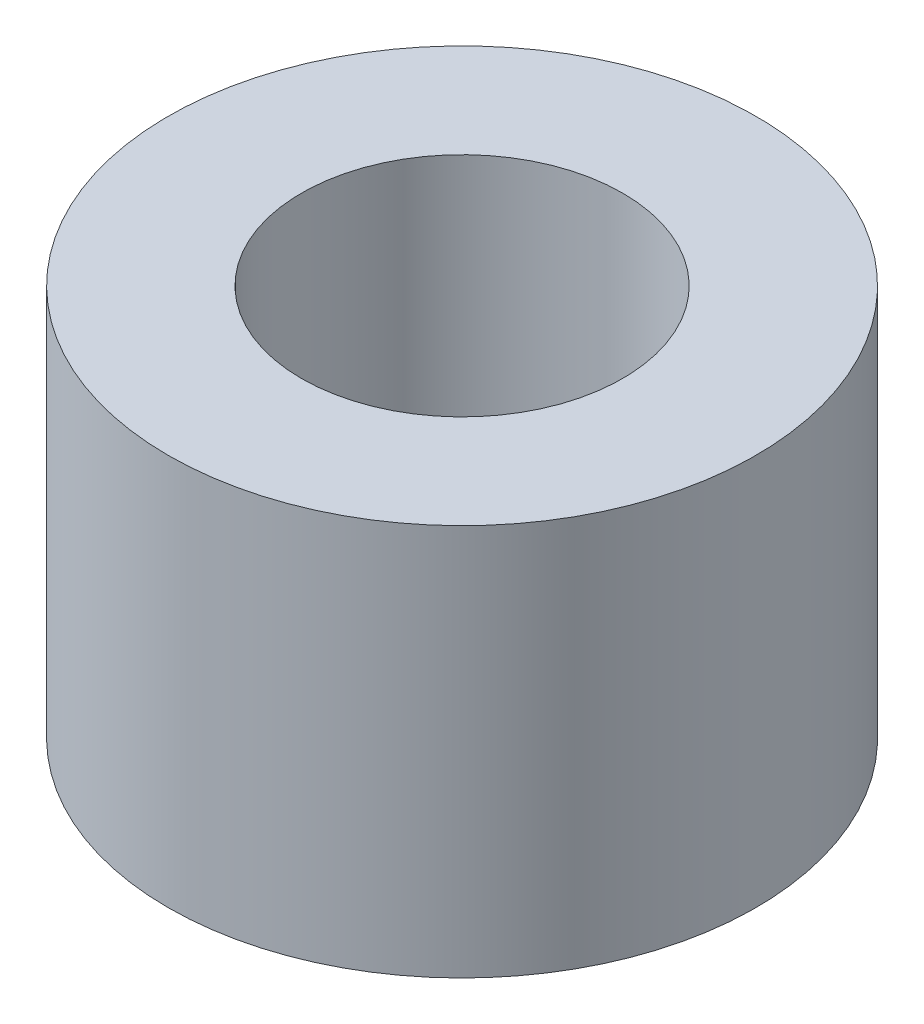
ISO-10303-21;
HEADER;
FILE_DESCRIPTION(('STEP AP214'),'2;1');
FILE_NAME('part.step','',(''),(''),'','','');
FILE_SCHEMA(('AUTOMOTIVE_DESIGN { 1 0 10303 214 1 1 1 1 }'));
ENDSEC;
DATA;
#1=APPLICATION_CONTEXT('core data for automotive mechanical design processes');
#2=APPLICATION_PROTOCOL_DEFINITION('international standard','automotive_design',2000,#1);
#3=PRODUCT_CONTEXT('',#1,'mechanical');
#4=PRODUCT('Part','Part','',(#3));
#5=PRODUCT_RELATED_PRODUCT_CATEGORY('part','',(#4));
#6=PRODUCT_DEFINITION_FORMATION('','',#4);
#7=PRODUCT_DEFINITION_CONTEXT('part definition',#1,'design');
#8=PRODUCT_DEFINITION('design','',#6,#7);
#9=PRODUCT_DEFINITION_SHAPE('','',#8);
#10=(LENGTH_UNIT() NAMED_UNIT(*) SI_UNIT(.MILLI.,.METRE.));
#11=(NAMED_UNIT(*) PLANE_ANGLE_UNIT() SI_UNIT($,.RADIAN.));
#12=(NAMED_UNIT(*) SI_UNIT($,.STERADIAN.) SOLID_ANGLE_UNIT());
#13=UNCERTAINTY_MEASURE_WITH_UNIT(LENGTH_MEASURE(1.E-05),#10,'distance_accuracy_value','');
#14=(GEOMETRIC_REPRESENTATION_CONTEXT(3) GLOBAL_UNCERTAINTY_ASSIGNED_CONTEXT((#13)) GLOBAL_UNIT_ASSIGNED_CONTEXT((#10,
#11,#12)) REPRESENTATION_CONTEXT('',''));
#15=CARTESIAN_POINT('',(0.,0.,0.));
#16=DIRECTION('',(0.,0.,1.));
#17=DIRECTION('',(1.,0.,0.));
#18=AXIS2_PLACEMENT_3D('',#15,#16,#17);
#19=CARTESIAN_POINT('',(0.,10.,0.));
#20=DIRECTION('',(0.,1.,0.));
#21=DIRECTION('',(0.,0.,1.));
#22=AXIS2_PLACEMENT_3D('',#19,#20,#21);
#23=PLANE('',#22);
#24=CARTESIAN_POINT('',(0.,10.,0.));
#25=DIRECTION('',(0.,1.,0.));
#26=DIRECTION('',(0.,0.,1.));
#27=AXIS2_PLACEMENT_3D('',#24,#25,#26);
#28=CIRCLE('',#27,7.5);
#29=CARTESIAN_POINT('',(0.,10.,7.5));
#30=VERTEX_POINT('',#29);
#31=EDGE_CURVE('E10',#30,#30,#28,.T.);
#32=ORIENTED_EDGE('',*,*,#31,.T.);
#33=EDGE_LOOP('',(#32));
#34=FACE_BOUND('',#33,.T.);
#35=CARTESIAN_POINT('',(0.,10.,0.));
#36=DIRECTION('',(0.,1.,0.));
#37=DIRECTION('',(0.,0.,1.));
#38=AXIS2_PLACEMENT_3D('',#35,#36,#37);
#39=CIRCLE('',#38,4.1);
#40=CARTESIAN_POINT('',(0.,10.,4.1));
#41=VERTEX_POINT('',#40);
#42=EDGE_CURVE('E42',#41,#41,#39,.T.);
#43=ORIENTED_EDGE('',*,*,#42,.F.);
#44=EDGE_LOOP('',(#43));
#45=FACE_BOUND('',#44,.T.);
#46=ADVANCED_FACE('F31',(#34,#45),#23,.T.);
#47=CARTESIAN_POINT('',(0.,0.,0.));
#48=DIRECTION('',(0.,1.,0.));
#49=DIRECTION('',(0.,0.,1.));
#50=AXIS2_PLACEMENT_3D('',#47,#48,#49);
#51=PLANE('',#50);
#52=CARTESIAN_POINT('',(0.,0.,0.));
#53=DIRECTION('',(0.,1.,0.));
#54=DIRECTION('',(0.,0.,1.));
#55=AXIS2_PLACEMENT_3D('',#52,#53,#54);
#56=CIRCLE('',#55,7.5);
#57=CARTESIAN_POINT('',(0.,0.,7.5));
#58=VERTEX_POINT('',#57);
#59=EDGE_CURVE('E35',#58,#58,#56,.T.);
#60=ORIENTED_EDGE('',*,*,#59,.F.);
#61=EDGE_LOOP('',(#60));
#62=FACE_BOUND('',#61,.T.);
#63=CARTESIAN_POINT('',(0.,0.,0.));
#64=DIRECTION('',(0.,1.,0.));
#65=DIRECTION('',(0.,0.,1.));
#66=AXIS2_PLACEMENT_3D('',#63,#64,#65);
#67=CIRCLE('',#66,4.1);
#68=CARTESIAN_POINT('',(0.,0.,4.1));
#69=VERTEX_POINT('',#68);
#70=EDGE_CURVE('E44',#69,#69,#67,.T.);
#71=ORIENTED_EDGE('',*,*,#70,.T.);
#72=EDGE_LOOP('',(#71));
#73=FACE_BOUND('',#72,.T.);
#74=ADVANCED_FACE('F54',(#62,#73),#51,.F.);
#75=CARTESIAN_POINT('',(0.,10.,0.));
#76=DIRECTION('',(0.,-1.,0.));
#77=DIRECTION('',(0.,0.,-1.));
#78=AXIS2_PLACEMENT_3D('',#75,#76,#77);
#79=CYLINDRICAL_SURFACE('',#78,7.5);
#80=ORIENTED_EDGE('',*,*,#31,.F.);
#81=EDGE_LOOP('',(#80));
#82=FACE_BOUND('',#81,.T.);
#83=ORIENTED_EDGE('',*,*,#59,.T.);
#84=EDGE_LOOP('',(#83));
#85=FACE_BOUND('',#84,.T.);
#86=ADVANCED_FACE('F33',(#82,#85),#79,.T.);
#87=CARTESIAN_POINT('',(0.,10.,0.));
#88=DIRECTION('',(0.,-1.,0.));
#89=DIRECTION('',(0.,0.,-1.));
#90=AXIS2_PLACEMENT_3D('',#87,#88,#89);
#91=CYLINDRICAL_SURFACE('',#90,4.1);
#92=ORIENTED_EDGE('',*,*,#42,.T.);
#93=EDGE_LOOP('',(#92));
#94=FACE_BOUND('',#93,.T.);
#95=ORIENTED_EDGE('',*,*,#70,.F.);
#96=EDGE_LOOP('',(#95));
#97=FACE_BOUND('',#96,.T.);
#98=ADVANCED_FACE('F50',(#94,#97),#91,.F.);
#99=CLOSED_SHELL('',(#46,#74,#86,#98));
#100=MANIFOLD_SOLID_BREP('B2',#99);
#101=ADVANCED_BREP_SHAPE_REPRESENTATION('',(#18,#100),#14);
#102=SHAPE_DEFINITION_REPRESENTATION(#9,#101);
ENDSEC;
END-ISO-10303-21;
